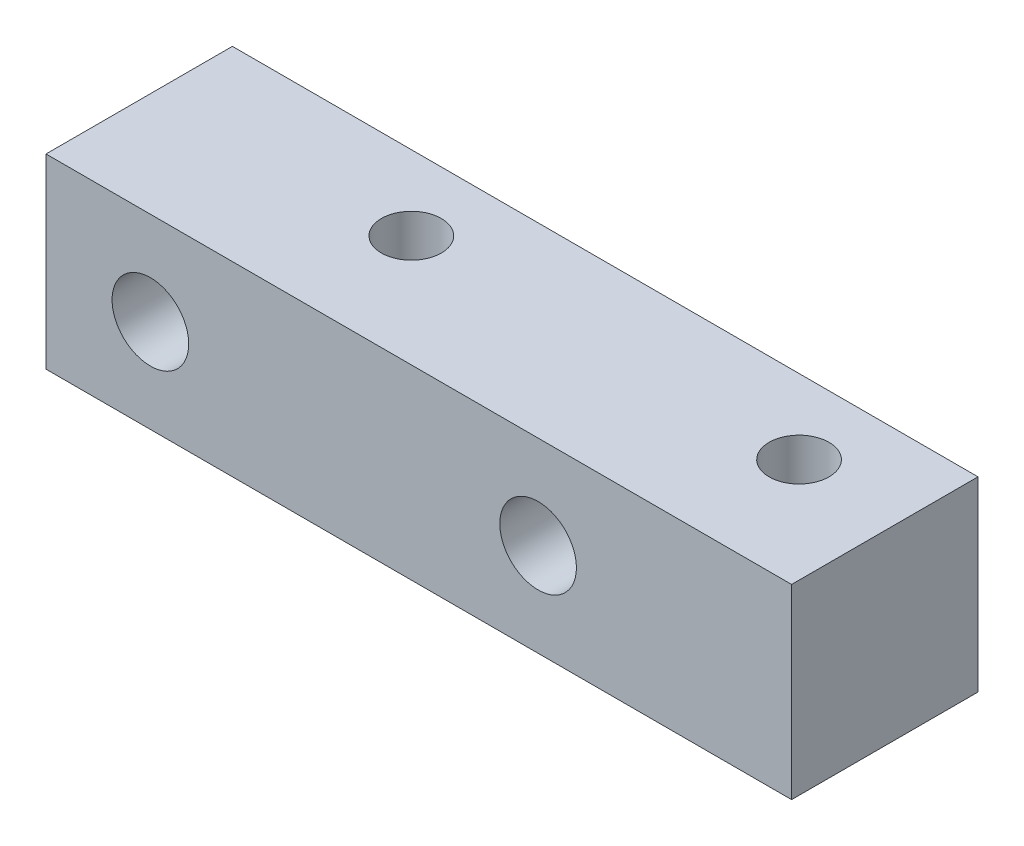
ISO-10303-21;
HEADER;
FILE_DESCRIPTION(('STEP AP214'),'2;1');
FILE_NAME('part.step','',(''),(''),'','','');
FILE_SCHEMA(('AUTOMOTIVE_DESIGN { 1 0 10303 214 1 1 1 1 }'));
ENDSEC;
DATA;
#1=APPLICATION_CONTEXT('core data for automotive mechanical design processes');
#2=APPLICATION_PROTOCOL_DEFINITION('international standard','automotive_design',2000,#1);
#3=PRODUCT_CONTEXT('',#1,'mechanical');
#4=PRODUCT('Part','Part','',(#3));
#5=PRODUCT_RELATED_PRODUCT_CATEGORY('part','',(#4));
#6=PRODUCT_DEFINITION_FORMATION('','',#4);
#7=PRODUCT_DEFINITION_CONTEXT('part definition',#1,'design');
#8=PRODUCT_DEFINITION('design','',#6,#7);
#9=PRODUCT_DEFINITION_SHAPE('','',#8);
#10=(LENGTH_UNIT() NAMED_UNIT(*) SI_UNIT(.MILLI.,.METRE.));
#11=(NAMED_UNIT(*) PLANE_ANGLE_UNIT() SI_UNIT($,.RADIAN.));
#12=(NAMED_UNIT(*) SI_UNIT($,.STERADIAN.) SOLID_ANGLE_UNIT());
#13=UNCERTAINTY_MEASURE_WITH_UNIT(LENGTH_MEASURE(1.E-05),#10,'distance_accuracy_value','');
#14=(GEOMETRIC_REPRESENTATION_CONTEXT(3) GLOBAL_UNCERTAINTY_ASSIGNED_CONTEXT((#13)) GLOBAL_UNIT_ASSIGNED_CONTEXT((#10,
#11,#12)) REPRESENTATION_CONTEXT('',''));
#15=CARTESIAN_POINT('',(0.,0.,0.));
#16=DIRECTION('',(0.,0.,1.));
#17=DIRECTION('',(1.,0.,0.));
#18=AXIS2_PLACEMENT_3D('',#15,#16,#17);
#19=CARTESIAN_POINT('',(31.75,-15.875,-7.9375));
#20=DIRECTION('',(1.,0.,0.));
#21=DIRECTION('',(0.,0.,-1.));
#22=AXIS2_PLACEMENT_3D('',#19,#20,#21);
#23=PLANE('',#22);
#24=DIRECTION('',(0.,0.,-1.));
#25=VECTOR('',#24,1.);
#26=CARTESIAN_POINT('',(31.75,0.,-7.9375));
#27=LINE('',#26,#25);
#28=CARTESIAN_POINT('',(31.75,0.,7.9375));
#29=VERTEX_POINT('',#28);
#30=CARTESIAN_POINT('',(31.75,0.,-7.9375));
#31=VERTEX_POINT('',#30);
#32=EDGE_CURVE('E103',#29,#31,#27,.T.);
#33=ORIENTED_EDGE('',*,*,#32,.F.);
#34=DIRECTION('',(0.,1.,0.));
#35=VECTOR('',#34,1.);
#36=CARTESIAN_POINT('',(31.75,-15.875,7.9375));
#37=LINE('',#36,#35);
#38=CARTESIAN_POINT('',(31.75,-15.875,7.9375));
#39=VERTEX_POINT('',#38);
#40=EDGE_CURVE('E11',#39,#29,#37,.T.);
#41=ORIENTED_EDGE('',*,*,#40,.F.);
#42=DIRECTION('',(0.,0.,-1.));
#43=VECTOR('',#42,1.);
#44=CARTESIAN_POINT('',(31.75,-15.875,-7.9375));
#45=LINE('',#44,#43);
#46=CARTESIAN_POINT('',(31.75,-15.875,-7.9375));
#47=VERTEX_POINT('',#46);
#48=EDGE_CURVE('E96',#39,#47,#45,.T.);
#49=ORIENTED_EDGE('',*,*,#48,.T.);
#50=DIRECTION('',(0.,1.,0.));
#51=VECTOR('',#50,1.);
#52=CARTESIAN_POINT('',(31.75,-15.875,-7.9375));
#53=LINE('',#52,#51);
#54=EDGE_CURVE('E41',#47,#31,#53,.T.);
#55=ORIENTED_EDGE('',*,*,#54,.T.);
#56=EDGE_LOOP('',(#33,#41,#49,#55));
#57=FACE_BOUND('',#56,.T.);
#58=ADVANCED_FACE('F38',(#57),#23,.T.);
#59=CARTESIAN_POINT('',(-31.75,-15.875,7.9375));
#60=DIRECTION('',(0.,0.,1.));
#61=DIRECTION('',(1.,0.,0.));
#62=AXIS2_PLACEMENT_3D('',#59,#60,#61);
#63=PLANE('',#62);
#64=CARTESIAN_POINT('',(-22.86,-7.9375,7.9375));
#65=DIRECTION('',(0.,0.,1.));
#66=DIRECTION('',(1.,0.,0.));
#67=AXIS2_PLACEMENT_3D('',#64,#65,#66);
#68=CIRCLE('',#67,3.2639);
#69=CARTESIAN_POINT('',(-19.5961,-7.9375,7.9375));
#70=VERTEX_POINT('',#69);
#71=EDGE_CURVE('E189',#70,#70,#68,.T.);
#72=ORIENTED_EDGE('',*,*,#71,.F.);
#73=EDGE_LOOP('',(#72));
#74=FACE_BOUND('',#73,.T.);
#75=CARTESIAN_POINT('',(10.16,-7.9375,7.9375));
#76=DIRECTION('',(0.,0.,1.));
#77=DIRECTION('',(1.,0.,0.));
#78=AXIS2_PLACEMENT_3D('',#75,#76,#77);
#79=CIRCLE('',#78,3.2639);
#80=CARTESIAN_POINT('',(13.4239,-7.9375,7.9375));
#81=VERTEX_POINT('',#80);
#82=EDGE_CURVE('E142',#81,#81,#79,.T.);
#83=ORIENTED_EDGE('',*,*,#82,.F.);
#84=EDGE_LOOP('',(#83));
#85=FACE_BOUND('',#84,.T.);
#86=DIRECTION('',(1.,0.,0.));
#87=VECTOR('',#86,1.);
#88=CARTESIAN_POINT('',(-31.75,0.,7.9375));
#89=LINE('',#88,#87);
#90=CARTESIAN_POINT('',(-31.75,0.,7.9375));
#91=VERTEX_POINT('',#90);
#92=EDGE_CURVE('E98',#91,#29,#89,.T.);
#93=ORIENTED_EDGE('',*,*,#92,.F.);
#94=DIRECTION('',(0.,1.,0.));
#95=VECTOR('',#94,1.);
#96=CARTESIAN_POINT('',(-31.75,-15.875,7.9375));
#97=LINE('',#96,#95);
#98=CARTESIAN_POINT('',(-31.75,-15.875,7.9375));
#99=VERTEX_POINT('',#98);
#100=EDGE_CURVE('E47',#99,#91,#97,.T.);
#101=ORIENTED_EDGE('',*,*,#100,.F.);
#102=DIRECTION('',(1.,0.,0.));
#103=VECTOR('',#102,1.);
#104=CARTESIAN_POINT('',(-31.75,-15.875,7.9375));
#105=LINE('',#104,#103);
#106=EDGE_CURVE('E93',#99,#39,#105,.T.);
#107=ORIENTED_EDGE('',*,*,#106,.T.);
#108=ORIENTED_EDGE('',*,*,#40,.T.);
#109=EDGE_LOOP('',(#93,#101,#107,#108));
#110=FACE_BOUND('',#109,.T.);
#111=ADVANCED_FACE('F114',(#74,#85,#110),#63,.T.);
#112=CARTESIAN_POINT('',(-31.75,-15.875,-7.9375));
#113=DIRECTION('',(-1.,0.,0.));
#114=DIRECTION('',(0.,0.,1.));
#115=AXIS2_PLACEMENT_3D('',#112,#113,#114);
#116=PLANE('',#115);
#117=DIRECTION('',(0.,0.,1.));
#118=VECTOR('',#117,1.);
#119=CARTESIAN_POINT('',(-31.75,0.,-7.9375));
#120=LINE('',#119,#118);
#121=CARTESIAN_POINT('',(-31.75,0.,-7.9375));
#122=VERTEX_POINT('',#121);
#123=EDGE_CURVE('E88',#122,#91,#120,.T.);
#124=ORIENTED_EDGE('',*,*,#123,.F.);
#125=DIRECTION('',(0.,1.,0.));
#126=VECTOR('',#125,1.);
#127=CARTESIAN_POINT('',(-31.75,-15.875,-7.9375));
#128=LINE('',#127,#126);
#129=CARTESIAN_POINT('',(-31.75,-15.875,-7.9375));
#130=VERTEX_POINT('',#129);
#131=EDGE_CURVE('E83',#130,#122,#128,.T.);
#132=ORIENTED_EDGE('',*,*,#131,.F.);
#133=DIRECTION('',(0.,0.,1.));
#134=VECTOR('',#133,1.);
#135=CARTESIAN_POINT('',(-31.75,-15.875,-7.9375));
#136=LINE('',#135,#134);
#137=EDGE_CURVE('E86',#130,#99,#136,.T.);
#138=ORIENTED_EDGE('',*,*,#137,.T.);
#139=ORIENTED_EDGE('',*,*,#100,.T.);
#140=EDGE_LOOP('',(#124,#132,#138,#139));
#141=FACE_BOUND('',#140,.T.);
#142=ADVANCED_FACE('F85',(#141),#116,.T.);
#143=CARTESIAN_POINT('',(-31.75,-15.875,-7.9375));
#144=DIRECTION('',(0.,0.,-1.));
#145=DIRECTION('',(-1.,0.,0.));
#146=AXIS2_PLACEMENT_3D('',#143,#144,#145);
#147=PLANE('',#146);
#148=CARTESIAN_POINT('',(-22.86,-7.9375,-7.9375));
#149=DIRECTION('',(0.,0.,1.));
#150=DIRECTION('',(1.,0.,0.));
#151=AXIS2_PLACEMENT_3D('',#148,#149,#150);
#152=CIRCLE('',#151,3.2639);
#153=CARTESIAN_POINT('',(-19.5961,-7.9375,-7.9375));
#154=VERTEX_POINT('',#153);
#155=EDGE_CURVE('E136',#154,#154,#152,.T.);
#156=ORIENTED_EDGE('',*,*,#155,.T.);
#157=EDGE_LOOP('',(#156));
#158=FACE_BOUND('',#157,.T.);
#159=CARTESIAN_POINT('',(10.16,-7.9375,-7.9375));
#160=DIRECTION('',(0.,0.,1.));
#161=DIRECTION('',(1.,0.,0.));
#162=AXIS2_PLACEMENT_3D('',#159,#160,#161);
#163=CIRCLE('',#162,3.2639);
#164=CARTESIAN_POINT('',(13.4239,-7.9375,-7.9375));
#165=VERTEX_POINT('',#164);
#166=EDGE_CURVE('E139',#165,#165,#163,.T.);
#167=ORIENTED_EDGE('',*,*,#166,.T.);
#168=EDGE_LOOP('',(#167));
#169=FACE_BOUND('',#168,.T.);
#170=DIRECTION('',(-1.,0.,0.));
#171=VECTOR('',#170,1.);
#172=CARTESIAN_POINT('',(-31.75,0.,-7.9375));
#173=LINE('',#172,#171);
#174=EDGE_CURVE('E106',#31,#122,#173,.T.);
#175=ORIENTED_EDGE('',*,*,#174,.F.);
#176=ORIENTED_EDGE('',*,*,#54,.F.);
#177=DIRECTION('',(-1.,0.,0.));
#178=VECTOR('',#177,1.);
#179=CARTESIAN_POINT('',(-31.75,-15.875,-7.9375));
#180=LINE('',#179,#178);
#181=EDGE_CURVE('E92',#47,#130,#180,.T.);
#182=ORIENTED_EDGE('',*,*,#181,.T.);
#183=ORIENTED_EDGE('',*,*,#131,.T.);
#184=EDGE_LOOP('',(#175,#176,#182,#183));
#185=FACE_BOUND('',#184,.T.);
#186=ADVANCED_FACE('F95',(#158,#169,#185),#147,.T.);
#187=CARTESIAN_POINT('',(0.,-15.875,0.));
#188=DIRECTION('',(0.,1.,0.));
#189=DIRECTION('',(0.,0.,1.));
#190=AXIS2_PLACEMENT_3D('',#187,#188,#189);
#191=PLANE('',#190);
#192=CARTESIAN_POINT('',(-10.16,-15.875,-1.5875));
#193=DIRECTION('',(0.,1.,0.));
#194=DIRECTION('',(0.,0.,1.));
#195=AXIS2_PLACEMENT_3D('',#192,#193,#194);
#196=CIRCLE('',#195,2.5527);
#197=CARTESIAN_POINT('',(-10.16,-15.875,0.965199999999997));
#198=VERTEX_POINT('',#197);
#199=EDGE_CURVE('E145',#198,#198,#196,.T.);
#200=ORIENTED_EDGE('',*,*,#199,.T.);
#201=EDGE_LOOP('',(#200));
#202=FACE_BOUND('',#201,.T.);
#203=CARTESIAN_POINT('',(22.86,-15.875,-1.5875));
#204=DIRECTION('',(0.,1.,0.));
#205=DIRECTION('',(0.,0.,1.));
#206=AXIS2_PLACEMENT_3D('',#203,#204,#205);
#207=CIRCLE('',#206,2.5527);
#208=CARTESIAN_POINT('',(22.86,-15.875,0.965199999999998));
#209=VERTEX_POINT('',#208);
#210=EDGE_CURVE('E107',#209,#209,#207,.T.);
#211=ORIENTED_EDGE('',*,*,#210,.T.);
#212=EDGE_LOOP('',(#211));
#213=FACE_BOUND('',#212,.T.);
#214=ORIENTED_EDGE('',*,*,#48,.F.);
#215=ORIENTED_EDGE('',*,*,#106,.F.);
#216=ORIENTED_EDGE('',*,*,#137,.F.);
#217=ORIENTED_EDGE('',*,*,#181,.F.);
#218=EDGE_LOOP('',(#214,#215,#216,#217));
#219=FACE_BOUND('',#218,.T.);
#220=ADVANCED_FACE('F91',(#202,#213,#219),#191,.F.);
#221=CARTESIAN_POINT('',(0.,0.,0.));
#222=DIRECTION('',(0.,1.,0.));
#223=DIRECTION('',(0.,0.,1.));
#224=AXIS2_PLACEMENT_3D('',#221,#222,#223);
#225=PLANE('',#224);
#226=CARTESIAN_POINT('',(-10.16,0.,-1.5875));
#227=DIRECTION('',(0.,1.,0.));
#228=DIRECTION('',(0.,0.,1.));
#229=AXIS2_PLACEMENT_3D('',#226,#227,#228);
#230=CIRCLE('',#229,2.55269999999999);
#231=CARTESIAN_POINT('',(-10.16,0.,0.965199999999987));
#232=VERTEX_POINT('',#231);
#233=EDGE_CURVE('E141',#232,#232,#230,.T.);
#234=ORIENTED_EDGE('',*,*,#233,.F.);
#235=EDGE_LOOP('',(#234));
#236=FACE_BOUND('',#235,.T.);
#237=CARTESIAN_POINT('',(22.86,0.,-1.5875));
#238=DIRECTION('',(0.,1.,0.));
#239=DIRECTION('',(0.,0.,1.));
#240=AXIS2_PLACEMENT_3D('',#237,#238,#239);
#241=CIRCLE('',#240,2.55269999999999);
#242=CARTESIAN_POINT('',(22.86,0.,0.965199999999987));
#243=VERTEX_POINT('',#242);
#244=EDGE_CURVE('E153',#243,#243,#241,.T.);
#245=ORIENTED_EDGE('',*,*,#244,.F.);
#246=EDGE_LOOP('',(#245));
#247=FACE_BOUND('',#246,.T.);
#248=ORIENTED_EDGE('',*,*,#32,.T.);
#249=ORIENTED_EDGE('',*,*,#174,.T.);
#250=ORIENTED_EDGE('',*,*,#123,.T.);
#251=ORIENTED_EDGE('',*,*,#92,.T.);
#252=EDGE_LOOP('',(#248,#249,#250,#251));
#253=FACE_BOUND('',#252,.T.);
#254=ADVANCED_FACE('F113',(#236,#247,#253),#225,.T.);
#255=CARTESIAN_POINT('',(22.86,0.,-1.5875));
#256=DIRECTION('',(0.,1.,0.));
#257=DIRECTION('',(0.,0.,1.));
#258=AXIS2_PLACEMENT_3D('',#255,#256,#257);
#259=CYLINDRICAL_SURFACE('',#258,2.55269999999999);
#260=ORIENTED_EDGE('',*,*,#210,.F.);
#261=EDGE_LOOP('',(#260));
#262=FACE_BOUND('',#261,.T.);
#263=ORIENTED_EDGE('',*,*,#244,.T.);
#264=EDGE_LOOP('',(#263));
#265=FACE_BOUND('',#264,.T.);
#266=ADVANCED_FACE('F159',(#262,#265),#259,.F.);
#267=CARTESIAN_POINT('',(-10.16,0.,-1.5875));
#268=DIRECTION('',(0.,1.,0.));
#269=DIRECTION('',(0.,0.,1.));
#270=AXIS2_PLACEMENT_3D('',#267,#268,#269);
#271=CYLINDRICAL_SURFACE('',#270,2.55269999999999);
#272=ORIENTED_EDGE('',*,*,#199,.F.);
#273=EDGE_LOOP('',(#272));
#274=FACE_BOUND('',#273,.T.);
#275=ORIENTED_EDGE('',*,*,#233,.T.);
#276=EDGE_LOOP('',(#275));
#277=FACE_BOUND('',#276,.T.);
#278=ADVANCED_FACE('F162',(#274,#277),#271,.F.);
#279=CARTESIAN_POINT('',(10.16,-7.9375,7.9375));
#280=DIRECTION('',(0.,0.,1.));
#281=DIRECTION('',(1.,0.,0.));
#282=AXIS2_PLACEMENT_3D('',#279,#280,#281);
#283=CYLINDRICAL_SURFACE('',#282,3.2639);
#284=ORIENTED_EDGE('',*,*,#166,.F.);
#285=EDGE_LOOP('',(#284));
#286=FACE_BOUND('',#285,.T.);
#287=ORIENTED_EDGE('',*,*,#82,.T.);
#288=EDGE_LOOP('',(#287));
#289=FACE_BOUND('',#288,.T.);
#290=ADVANCED_FACE('F173',(#286,#289),#283,.F.);
#291=CARTESIAN_POINT('',(-22.86,-7.9375,7.9375));
#292=DIRECTION('',(0.,0.,1.));
#293=DIRECTION('',(1.,0.,0.));
#294=AXIS2_PLACEMENT_3D('',#291,#292,#293);
#295=CYLINDRICAL_SURFACE('',#294,3.2639);
#296=ORIENTED_EDGE('',*,*,#155,.F.);
#297=EDGE_LOOP('',(#296));
#298=FACE_BOUND('',#297,.T.);
#299=ORIENTED_EDGE('',*,*,#71,.T.);
#300=EDGE_LOOP('',(#299));
#301=FACE_BOUND('',#300,.T.);
#302=ADVANCED_FACE('F179',(#298,#301),#295,.F.);
#303=CLOSED_SHELL('',(#58,#111,#142,#186,#220,#254,#266,#278,#290,#302));
#304=MANIFOLD_SOLID_BREP('B2',#303);
#305=ADVANCED_BREP_SHAPE_REPRESENTATION('',(#18,#304),#14);
#306=SHAPE_DEFINITION_REPRESENTATION(#9,#305);
ENDSEC;
END-ISO-10303-21;
